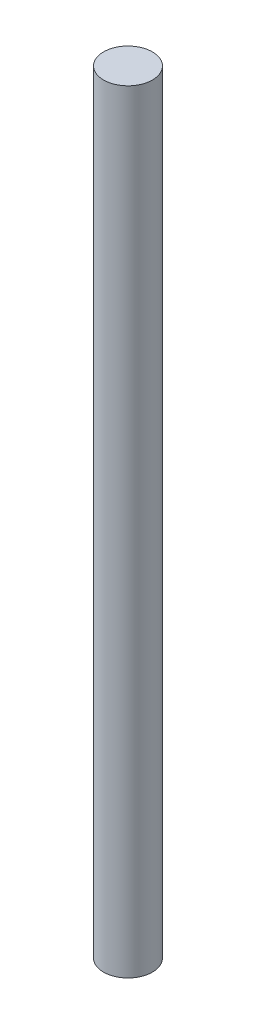
ISO-10303-21;
HEADER;
FILE_DESCRIPTION(('STEP AP214'),'2;1');
FILE_NAME('part.step','',(''),(''),'','','');
FILE_SCHEMA(('AUTOMOTIVE_DESIGN { 1 0 10303 214 1 1 1 1 }'));
ENDSEC;
DATA;
#1=APPLICATION_CONTEXT('core data for automotive mechanical design processes');
#2=APPLICATION_PROTOCOL_DEFINITION('international standard','automotive_design',2000,#1);
#3=PRODUCT_CONTEXT('',#1,'mechanical');
#4=PRODUCT('Part','Part','',(#3));
#5=PRODUCT_RELATED_PRODUCT_CATEGORY('part','',(#4));
#6=PRODUCT_DEFINITION_FORMATION('','',#4);
#7=PRODUCT_DEFINITION_CONTEXT('part definition',#1,'design');
#8=PRODUCT_DEFINITION('design','',#6,#7);
#9=PRODUCT_DEFINITION_SHAPE('','',#8);
#10=(LENGTH_UNIT() NAMED_UNIT(*) SI_UNIT(.MILLI.,.METRE.));
#11=(NAMED_UNIT(*) PLANE_ANGLE_UNIT() SI_UNIT($,.RADIAN.));
#12=(NAMED_UNIT(*) SI_UNIT($,.STERADIAN.) SOLID_ANGLE_UNIT());
#13=UNCERTAINTY_MEASURE_WITH_UNIT(LENGTH_MEASURE(1.E-05),#10,'distance_accuracy_value','');
#14=(GEOMETRIC_REPRESENTATION_CONTEXT(3) GLOBAL_UNCERTAINTY_ASSIGNED_CONTEXT((#13)) GLOBAL_UNIT_ASSIGNED_CONTEXT((#10,
#11,#12)) REPRESENTATION_CONTEXT('',''));
#15=CARTESIAN_POINT('',(0.,0.,0.));
#16=DIRECTION('',(0.,0.,1.));
#17=DIRECTION('',(1.,0.,0.));
#18=AXIS2_PLACEMENT_3D('',#15,#16,#17);
#19=CARTESIAN_POINT('',(0.,28956.,0.));
#20=DIRECTION('',(0.,-1.,0.));
#21=DIRECTION('',(0.,0.,-1.));
#22=AXIS2_PLACEMENT_3D('',#19,#20,#21);
#23=CYLINDRICAL_SURFACE('',#22,914.4);
#24=CARTESIAN_POINT('',(0.,28956.,0.));
#25=DIRECTION('',(0.,1.,0.));
#26=DIRECTION('',(0.,0.,1.));
#27=AXIS2_PLACEMENT_3D('',#24,#25,#26);
#28=CIRCLE('',#27,914.4);
#29=CARTESIAN_POINT('',(0.,28956.,914.4));
#30=VERTEX_POINT('',#29);
#31=EDGE_CURVE('E10',#30,#30,#28,.T.);
#32=ORIENTED_EDGE('',*,*,#31,.F.);
#33=EDGE_LOOP('',(#32));
#34=FACE_BOUND('',#33,.T.);
#35=CARTESIAN_POINT('',(0.,0.,0.));
#36=DIRECTION('',(0.,1.,0.));
#37=DIRECTION('',(0.,0.,1.));
#38=AXIS2_PLACEMENT_3D('',#35,#36,#37);
#39=CIRCLE('',#38,914.4);
#40=CARTESIAN_POINT('',(0.,0.,914.4));
#41=VERTEX_POINT('',#40);
#42=EDGE_CURVE('E40',#41,#41,#39,.T.);
#43=ORIENTED_EDGE('',*,*,#42,.T.);
#44=EDGE_LOOP('',(#43));
#45=FACE_BOUND('',#44,.T.);
#46=ADVANCED_FACE('F37',(#34,#45),#23,.T.);
#47=CARTESIAN_POINT('',(0.,28956.,0.));
#48=DIRECTION('',(0.,1.,0.));
#49=DIRECTION('',(0.,0.,1.));
#50=AXIS2_PLACEMENT_3D('',#47,#48,#49);
#51=PLANE('',#50);
#52=ORIENTED_EDGE('',*,*,#31,.T.);
#53=EDGE_LOOP('',(#52));
#54=FACE_BOUND('',#53,.T.);
#55=ADVANCED_FACE('F54',(#54),#51,.T.);
#56=CARTESIAN_POINT('',(0.,0.,0.));
#57=DIRECTION('',(0.,1.,0.));
#58=DIRECTION('',(0.,0.,1.));
#59=AXIS2_PLACEMENT_3D('',#56,#57,#58);
#60=PLANE('',#59);
#61=ORIENTED_EDGE('',*,*,#42,.F.);
#62=EDGE_LOOP('',(#61));
#63=FACE_BOUND('',#62,.T.);
#64=ADVANCED_FACE('F52',(#63),#60,.F.);
#65=CLOSED_SHELL('',(#46,#55,#64));
#66=MANIFOLD_SOLID_BREP('B2',#65);
#67=ADVANCED_BREP_SHAPE_REPRESENTATION('',(#18,#66),#14);
#68=SHAPE_DEFINITION_REPRESENTATION(#9,#67);
ENDSEC;
END-ISO-10303-21;
